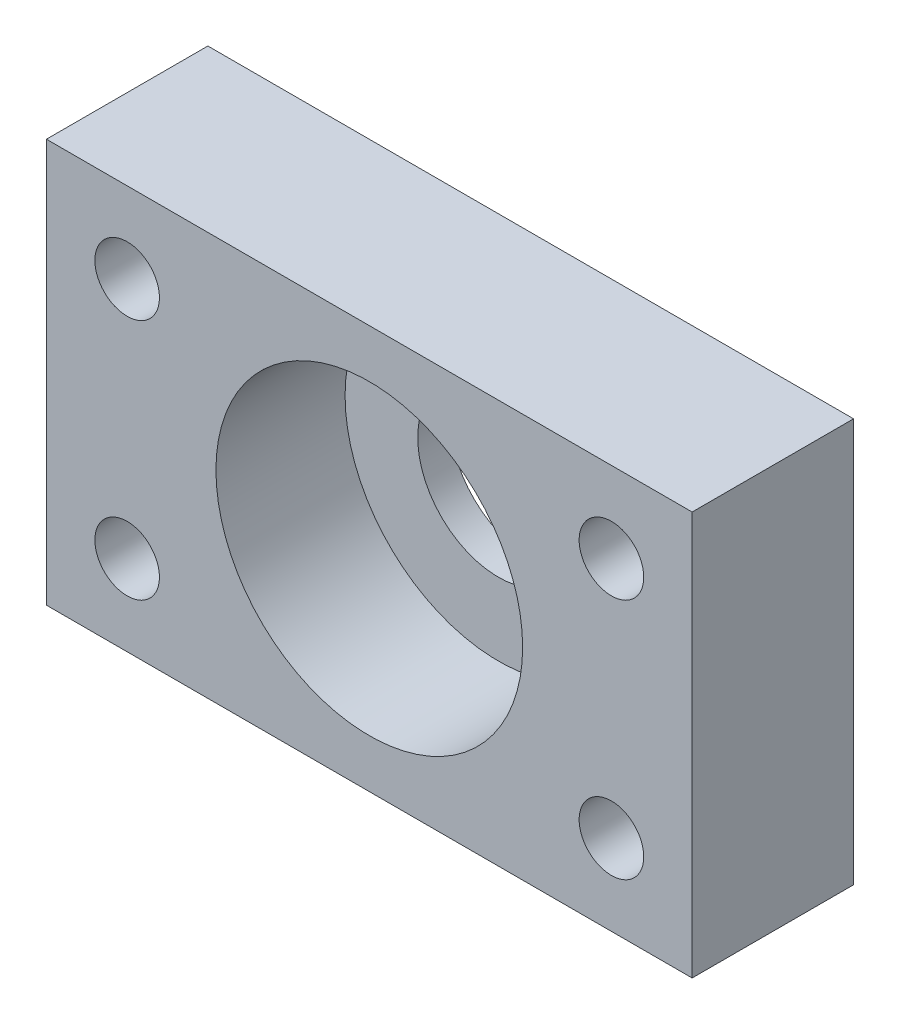
ISO-10303-21;
HEADER;
FILE_DESCRIPTION(('STEP AP214'),'2;1');
FILE_NAME('part.step','',(''),(''),'','','');
FILE_SCHEMA(('AUTOMOTIVE_DESIGN { 1 0 10303 214 1 1 1 1 }'));
ENDSEC;
DATA;
#1=APPLICATION_CONTEXT('core data for automotive mechanical design processes');
#2=APPLICATION_PROTOCOL_DEFINITION('international standard','automotive_design',2000,#1);
#3=PRODUCT_CONTEXT('',#1,'mechanical');
#4=PRODUCT('Part','Part','',(#3));
#5=PRODUCT_RELATED_PRODUCT_CATEGORY('part','',(#4));
#6=PRODUCT_DEFINITION_FORMATION('','',#4);
#7=PRODUCT_DEFINITION_CONTEXT('part definition',#1,'design');
#8=PRODUCT_DEFINITION('design','',#6,#7);
#9=PRODUCT_DEFINITION_SHAPE('','',#8);
#10=(LENGTH_UNIT() NAMED_UNIT(*) SI_UNIT(.MILLI.,.METRE.));
#11=(NAMED_UNIT(*) PLANE_ANGLE_UNIT() SI_UNIT($,.RADIAN.));
#12=(NAMED_UNIT(*) SI_UNIT($,.STERADIAN.) SOLID_ANGLE_UNIT());
#13=UNCERTAINTY_MEASURE_WITH_UNIT(LENGTH_MEASURE(1.E-05),#10,'distance_accuracy_value','');
#14=(GEOMETRIC_REPRESENTATION_CONTEXT(3) GLOBAL_UNCERTAINTY_ASSIGNED_CONTEXT((#13)) GLOBAL_UNIT_ASSIGNED_CONTEXT((#10,
#11,#12)) REPRESENTATION_CONTEXT('',''));
#15=CARTESIAN_POINT('',(0.,0.,0.));
#16=DIRECTION('',(0.,0.,1.));
#17=DIRECTION('',(1.,0.,0.));
#18=AXIS2_PLACEMENT_3D('',#15,#16,#17);
#19=CARTESIAN_POINT('',(5.17640495270519,0.,10.));
#20=DIRECTION('',(1.,0.,0.));
#21=DIRECTION('',(0.,1.,0.));
#22=AXIS2_PLACEMENT_3D('',#19,#20,#21);
#23=PLANE('',#22);
#24=DIRECTION('',(0.,-1.,0.));
#25=VECTOR('',#24,1.);
#26=CARTESIAN_POINT('',(5.17640495270519,0.,0.));
#27=LINE('',#26,#25);
#28=CARTESIAN_POINT('',(5.17640495270519,-9.74981387207115,0.));
#29=VERTEX_POINT('',#28);
#30=CARTESIAN_POINT('',(5.17640495270519,-34.7498138720712,0.));
#31=VERTEX_POINT('',#30);
#32=EDGE_CURVE('E119',#29,#31,#27,.T.);
#33=ORIENTED_EDGE('',*,*,#32,.F.);
#34=DIRECTION('',(0.,0.,-1.));
#35=VECTOR('',#34,1.);
#36=CARTESIAN_POINT('',(5.17640495270519,-9.74981387207115,10.));
#37=LINE('',#36,#35);
#38=CARTESIAN_POINT('',(5.17640495270519,-9.74981387207115,10.));
#39=VERTEX_POINT('',#38);
#40=EDGE_CURVE('E44',#39,#29,#37,.T.);
#41=ORIENTED_EDGE('',*,*,#40,.F.);
#42=DIRECTION('',(0.,-1.,0.));
#43=VECTOR('',#42,1.);
#44=CARTESIAN_POINT('',(5.17640495270519,0.,10.));
#45=LINE('',#44,#43);
#46=CARTESIAN_POINT('',(5.17640495270519,-34.7498138720712,10.));
#47=VERTEX_POINT('',#46);
#48=EDGE_CURVE('E99',#39,#47,#45,.T.);
#49=ORIENTED_EDGE('',*,*,#48,.T.);
#50=DIRECTION('',(0.,0.,-1.));
#51=VECTOR('',#50,1.);
#52=CARTESIAN_POINT('',(5.17640495270519,-34.7498138720712,10.));
#53=LINE('',#52,#51);
#54=EDGE_CURVE('E76',#47,#31,#53,.T.);
#55=ORIENTED_EDGE('',*,*,#54,.T.);
#56=EDGE_LOOP('',(#33,#41,#49,#55));
#57=FACE_BOUND('',#56,.T.);
#58=ADVANCED_FACE('F35',(#57),#23,.T.);
#59=CARTESIAN_POINT('',(0.,-9.74981387207115,10.));
#60=DIRECTION('',(0.,1.,0.));
#61=DIRECTION('',(0.,0.,1.));
#62=AXIS2_PLACEMENT_3D('',#59,#60,#61);
#63=PLANE('',#62);
#64=DIRECTION('',(1.,0.,0.));
#65=VECTOR('',#64,1.);
#66=CARTESIAN_POINT('',(0.,-9.74981387207115,0.));
#67=LINE('',#66,#65);
#68=CARTESIAN_POINT('',(-34.8235950472948,-9.74981387207115,0.));
#69=VERTEX_POINT('',#68);
#70=EDGE_CURVE('E89',#69,#29,#67,.T.);
#71=ORIENTED_EDGE('',*,*,#70,.F.);
#72=DIRECTION('',(0.,0.,-1.));
#73=VECTOR('',#72,1.);
#74=CARTESIAN_POINT('',(-34.8235950472948,-9.74981387207115,10.));
#75=LINE('',#74,#73);
#76=CARTESIAN_POINT('',(-34.8235950472948,-9.74981387207115,10.));
#77=VERTEX_POINT('',#76);
#78=EDGE_CURVE('E83',#77,#69,#75,.T.);
#79=ORIENTED_EDGE('',*,*,#78,.F.);
#80=DIRECTION('',(1.,0.,0.));
#81=VECTOR('',#80,1.);
#82=CARTESIAN_POINT('',(0.,-9.74981387207115,10.));
#83=LINE('',#82,#81);
#84=EDGE_CURVE('E87',#77,#39,#83,.T.);
#85=ORIENTED_EDGE('',*,*,#84,.T.);
#86=ORIENTED_EDGE('',*,*,#40,.T.);
#87=EDGE_LOOP('',(#71,#79,#85,#86));
#88=FACE_BOUND('',#87,.T.);
#89=ADVANCED_FACE('F85',(#88),#63,.T.);
#90=CARTESIAN_POINT('',(-34.8235950472948,0.,10.));
#91=DIRECTION('',(1.,0.,0.));
#92=DIRECTION('',(0.,1.,0.));
#93=AXIS2_PLACEMENT_3D('',#90,#91,#92);
#94=PLANE('',#93);
#95=DIRECTION('',(0.,-1.,0.));
#96=VECTOR('',#95,1.);
#97=CARTESIAN_POINT('',(-34.8235950472948,0.,0.));
#98=LINE('',#97,#96);
#99=CARTESIAN_POINT('',(-34.8235950472948,-34.7498138720712,0.));
#100=VERTEX_POINT('',#99);
#101=EDGE_CURVE('E122',#69,#100,#98,.T.);
#102=ORIENTED_EDGE('',*,*,#101,.T.);
#103=DIRECTION('',(0.,0.,-1.));
#104=VECTOR('',#103,1.);
#105=CARTESIAN_POINT('',(-34.8235950472948,-34.7498138720712,10.));
#106=LINE('',#105,#104);
#107=CARTESIAN_POINT('',(-34.8235950472948,-34.7498138720712,10.));
#108=VERTEX_POINT('',#107);
#109=EDGE_CURVE('E92',#108,#100,#106,.T.);
#110=ORIENTED_EDGE('',*,*,#109,.F.);
#111=DIRECTION('',(0.,-1.,0.));
#112=VECTOR('',#111,1.);
#113=CARTESIAN_POINT('',(-34.8235950472948,0.,10.));
#114=LINE('',#113,#112);
#115=EDGE_CURVE('E95',#77,#108,#114,.T.);
#116=ORIENTED_EDGE('',*,*,#115,.F.);
#117=ORIENTED_EDGE('',*,*,#78,.T.);
#118=EDGE_LOOP('',(#102,#110,#116,#117));
#119=FACE_BOUND('',#118,.T.);
#120=ADVANCED_FACE('F96',(#119),#94,.F.);
#121=CARTESIAN_POINT('',(-29.8235950472948,-14.7498138720712,10.));
#122=DIRECTION('',(0.,0.,-1.));
#123=DIRECTION('',(-1.,0.,0.));
#124=AXIS2_PLACEMENT_3D('',#121,#122,#123);
#125=CYLINDRICAL_SURFACE('',#124,2.);
#126=CARTESIAN_POINT('',(-29.8235950472948,-14.7498138720712,10.));
#127=DIRECTION('',(0.,0.,1.));
#128=DIRECTION('',(1.,0.,0.));
#129=AXIS2_PLACEMENT_3D('',#126,#127,#128);
#130=CIRCLE('',#129,2.);
#131=CARTESIAN_POINT('',(-27.8235950472948,-14.7498138720712,10.));
#132=VERTEX_POINT('',#131);
#133=EDGE_CURVE('E101',#132,#132,#130,.T.);
#134=ORIENTED_EDGE('',*,*,#133,.T.);
#135=EDGE_LOOP('',(#134));
#136=FACE_BOUND('',#135,.T.);
#137=CARTESIAN_POINT('',(-29.8235950472948,-14.7498138720712,0.));
#138=DIRECTION('',(0.,0.,1.));
#139=DIRECTION('',(1.,0.,0.));
#140=AXIS2_PLACEMENT_3D('',#137,#138,#139);
#141=CIRCLE('',#140,2.);
#142=CARTESIAN_POINT('',(-27.8235950472948,-14.7498138720712,0.));
#143=VERTEX_POINT('',#142);
#144=EDGE_CURVE('E116',#143,#143,#141,.T.);
#145=ORIENTED_EDGE('',*,*,#144,.F.);
#146=EDGE_LOOP('',(#145));
#147=FACE_BOUND('',#146,.T.);
#148=ADVANCED_FACE('F154',(#136,#147),#125,.F.);
#149=CARTESIAN_POINT('',(-29.8235950472948,-29.7498138720712,10.));
#150=DIRECTION('',(0.,0.,-1.));
#151=DIRECTION('',(-1.,0.,0.));
#152=AXIS2_PLACEMENT_3D('',#149,#150,#151);
#153=CYLINDRICAL_SURFACE('',#152,2.00000000000001);
#154=CARTESIAN_POINT('',(-29.8235950472948,-29.7498138720712,10.));
#155=DIRECTION('',(0.,0.,1.));
#156=DIRECTION('',(1.,0.,0.));
#157=AXIS2_PLACEMENT_3D('',#154,#155,#156);
#158=CIRCLE('',#157,2.00000000000001);
#159=CARTESIAN_POINT('',(-27.8235950472948,-29.7498138720712,10.));
#160=VERTEX_POINT('',#159);
#161=EDGE_CURVE('E149',#160,#160,#158,.T.);
#162=ORIENTED_EDGE('',*,*,#161,.T.);
#163=EDGE_LOOP('',(#162));
#164=FACE_BOUND('',#163,.T.);
#165=CARTESIAN_POINT('',(-29.8235950472948,-29.7498138720712,0.));
#166=DIRECTION('',(0.,0.,1.));
#167=DIRECTION('',(1.,0.,0.));
#168=AXIS2_PLACEMENT_3D('',#165,#166,#167);
#169=CIRCLE('',#168,2.00000000000001);
#170=CARTESIAN_POINT('',(-27.8235950472948,-29.7498138720712,0.));
#171=VERTEX_POINT('',#170);
#172=EDGE_CURVE('E113',#171,#171,#169,.T.);
#173=ORIENTED_EDGE('',*,*,#172,.F.);
#174=EDGE_LOOP('',(#173));
#175=FACE_BOUND('',#174,.T.);
#176=ADVANCED_FACE('F179',(#164,#175),#153,.F.);
#177=CARTESIAN_POINT('',(0.176404952705187,-14.7498138720711,10.));
#178=DIRECTION('',(0.,0.,-1.));
#179=DIRECTION('',(-1.,0.,0.));
#180=AXIS2_PLACEMENT_3D('',#177,#178,#179);
#181=CYLINDRICAL_SURFACE('',#180,2.);
#182=CARTESIAN_POINT('',(0.176404952705187,-14.7498138720711,10.));
#183=DIRECTION('',(0.,0.,1.));
#184=DIRECTION('',(1.,0.,0.));
#185=AXIS2_PLACEMENT_3D('',#182,#183,#184);
#186=CIRCLE('',#185,2.);
#187=CARTESIAN_POINT('',(2.17640495270519,-14.7498138720711,10.));
#188=VERTEX_POINT('',#187);
#189=EDGE_CURVE('E146',#188,#188,#186,.T.);
#190=ORIENTED_EDGE('',*,*,#189,.T.);
#191=EDGE_LOOP('',(#190));
#192=FACE_BOUND('',#191,.T.);
#193=CARTESIAN_POINT('',(0.176404952705187,-14.7498138720711,0.));
#194=DIRECTION('',(0.,0.,1.));
#195=DIRECTION('',(1.,0.,0.));
#196=AXIS2_PLACEMENT_3D('',#193,#194,#195);
#197=CIRCLE('',#196,2.);
#198=CARTESIAN_POINT('',(2.17640495270519,-14.7498138720711,0.));
#199=VERTEX_POINT('',#198);
#200=EDGE_CURVE('E109',#199,#199,#197,.T.);
#201=ORIENTED_EDGE('',*,*,#200,.F.);
#202=EDGE_LOOP('',(#201));
#203=FACE_BOUND('',#202,.T.);
#204=ADVANCED_FACE('F182',(#192,#203),#181,.F.);
#205=CARTESIAN_POINT('',(0.176404952705191,-29.7498138720711,10.));
#206=DIRECTION('',(0.,0.,-1.));
#207=DIRECTION('',(-1.,0.,0.));
#208=AXIS2_PLACEMENT_3D('',#205,#206,#207);
#209=CYLINDRICAL_SURFACE('',#208,2.);
#210=CARTESIAN_POINT('',(0.176404952705191,-29.7498138720711,10.));
#211=DIRECTION('',(0.,0.,1.));
#212=DIRECTION('',(1.,0.,0.));
#213=AXIS2_PLACEMENT_3D('',#210,#211,#212);
#214=CIRCLE('',#213,2.);
#215=CARTESIAN_POINT('',(2.17640495270519,-29.7498138720711,10.));
#216=VERTEX_POINT('',#215);
#217=EDGE_CURVE('E143',#216,#216,#214,.T.);
#218=ORIENTED_EDGE('',*,*,#217,.T.);
#219=EDGE_LOOP('',(#218));
#220=FACE_BOUND('',#219,.T.);
#221=CARTESIAN_POINT('',(0.176404952705191,-29.7498138720711,0.));
#222=DIRECTION('',(0.,0.,1.));
#223=DIRECTION('',(1.,0.,0.));
#224=AXIS2_PLACEMENT_3D('',#221,#222,#223);
#225=CIRCLE('',#224,2.);
#226=CARTESIAN_POINT('',(2.17640495270519,-29.7498138720711,0.));
#227=VERTEX_POINT('',#226);
#228=EDGE_CURVE('E106',#227,#227,#225,.T.);
#229=ORIENTED_EDGE('',*,*,#228,.F.);
#230=EDGE_LOOP('',(#229));
#231=FACE_BOUND('',#230,.T.);
#232=ADVANCED_FACE('F185',(#220,#231),#209,.F.);
#233=CARTESIAN_POINT('',(-14.8235950472948,-22.2498138720712,10.));
#234=DIRECTION('',(0.,0.,-1.));
#235=DIRECTION('',(-1.,0.,0.));
#236=AXIS2_PLACEMENT_3D('',#233,#234,#235);
#237=CYLINDRICAL_SURFACE('',#236,9.5);
#238=CARTESIAN_POINT('',(-14.8235950472948,-22.2498138720712,2.));
#239=DIRECTION('',(0.,0.,1.));
#240=DIRECTION('',(1.,0.,0.));
#241=AXIS2_PLACEMENT_3D('',#238,#239,#240);
#242=CIRCLE('',#241,9.5);
#243=CARTESIAN_POINT('',(-5.32359504729481,-22.2498138720712,2.));
#244=VERTEX_POINT('',#243);
#245=EDGE_CURVE('E11',#244,#244,#242,.T.);
#246=ORIENTED_EDGE('',*,*,#245,.F.);
#247=EDGE_LOOP('',(#246));
#248=FACE_BOUND('',#247,.T.);
#249=CARTESIAN_POINT('',(-14.8235950472948,-22.2498138720712,10.));
#250=DIRECTION('',(0.,0.,1.));
#251=DIRECTION('',(1.,0.,0.));
#252=AXIS2_PLACEMENT_3D('',#249,#250,#251);
#253=CIRCLE('',#252,9.5);
#254=CARTESIAN_POINT('',(-5.32359504729481,-22.2498138720712,10.));
#255=VERTEX_POINT('',#254);
#256=EDGE_CURVE('E125',#255,#255,#253,.T.);
#257=ORIENTED_EDGE('',*,*,#256,.T.);
#258=EDGE_LOOP('',(#257));
#259=FACE_BOUND('',#258,.T.);
#260=ADVANCED_FACE('F37',(#248,#259),#237,.F.);
#261=CARTESIAN_POINT('',(0.,-34.7498138720712,10.));
#262=DIRECTION('',(0.,1.,0.));
#263=DIRECTION('',(-1.,0.,0.));
#264=AXIS2_PLACEMENT_3D('',#261,#262,#263);
#265=PLANE('',#264);
#266=DIRECTION('',(1.,0.,0.));
#267=VECTOR('',#266,1.);
#268=CARTESIAN_POINT('',(0.,-34.7498138720712,0.));
#269=LINE('',#268,#267);
#270=EDGE_CURVE('E69',#100,#31,#269,.T.);
#271=ORIENTED_EDGE('',*,*,#270,.T.);
#272=ORIENTED_EDGE('',*,*,#54,.F.);
#273=DIRECTION('',(1.,0.,0.));
#274=VECTOR('',#273,1.);
#275=CARTESIAN_POINT('',(0.,-34.7498138720712,10.));
#276=LINE('',#275,#274);
#277=EDGE_CURVE('E52',#108,#47,#276,.T.);
#278=ORIENTED_EDGE('',*,*,#277,.F.);
#279=ORIENTED_EDGE('',*,*,#109,.T.);
#280=EDGE_LOOP('',(#271,#272,#278,#279));
#281=FACE_BOUND('',#280,.T.);
#282=ADVANCED_FACE('F158',(#281),#265,.F.);
#283=CARTESIAN_POINT('',(0.,0.,10.));
#284=DIRECTION('',(0.,0.,1.));
#285=DIRECTION('',(1.,0.,0.));
#286=AXIS2_PLACEMENT_3D('',#283,#284,#285);
#287=PLANE('',#286);
#288=ORIENTED_EDGE('',*,*,#256,.F.);
#289=EDGE_LOOP('',(#288));
#290=FACE_BOUND('',#289,.T.);
#291=ORIENTED_EDGE('',*,*,#217,.F.);
#292=EDGE_LOOP('',(#291));
#293=FACE_BOUND('',#292,.T.);
#294=ORIENTED_EDGE('',*,*,#189,.F.);
#295=EDGE_LOOP('',(#294));
#296=FACE_BOUND('',#295,.T.);
#297=ORIENTED_EDGE('',*,*,#161,.F.);
#298=EDGE_LOOP('',(#297));
#299=FACE_BOUND('',#298,.T.);
#300=ORIENTED_EDGE('',*,*,#133,.F.);
#301=EDGE_LOOP('',(#300));
#302=FACE_BOUND('',#301,.T.);
#303=ORIENTED_EDGE('',*,*,#48,.F.);
#304=ORIENTED_EDGE('',*,*,#84,.F.);
#305=ORIENTED_EDGE('',*,*,#115,.T.);
#306=ORIENTED_EDGE('',*,*,#277,.T.);
#307=EDGE_LOOP('',(#303,#304,#305,#306));
#308=FACE_BOUND('',#307,.T.);
#309=ADVANCED_FACE('F98',(#290,#293,#296,#299,#302,#308),#287,.T.);
#310=CARTESIAN_POINT('',(0.,0.,0.));
#311=DIRECTION('',(0.,0.,1.));
#312=DIRECTION('',(1.,0.,0.));
#313=AXIS2_PLACEMENT_3D('',#310,#311,#312);
#314=PLANE('',#313);
#315=ORIENTED_EDGE('',*,*,#228,.T.);
#316=EDGE_LOOP('',(#315));
#317=FACE_BOUND('',#316,.T.);
#318=ORIENTED_EDGE('',*,*,#200,.T.);
#319=EDGE_LOOP('',(#318));
#320=FACE_BOUND('',#319,.T.);
#321=ORIENTED_EDGE('',*,*,#172,.T.);
#322=EDGE_LOOP('',(#321));
#323=FACE_BOUND('',#322,.T.);
#324=ORIENTED_EDGE('',*,*,#144,.T.);
#325=EDGE_LOOP('',(#324));
#326=FACE_BOUND('',#325,.T.);
#327=ORIENTED_EDGE('',*,*,#32,.T.);
#328=ORIENTED_EDGE('',*,*,#270,.F.);
#329=ORIENTED_EDGE('',*,*,#101,.F.);
#330=ORIENTED_EDGE('',*,*,#70,.T.);
#331=EDGE_LOOP('',(#327,#328,#329,#330));
#332=FACE_BOUND('',#331,.T.);
#333=CARTESIAN_POINT('',(-14.8235950472948,-22.2498138720712,0.));
#334=DIRECTION('',(0.,0.,1.));
#335=DIRECTION('',(1.,0.,0.));
#336=AXIS2_PLACEMENT_3D('',#333,#334,#335);
#337=CIRCLE('',#336,5.);
#338=CARTESIAN_POINT('',(-9.82359504729481,-22.2498138720712,0.));
#339=VERTEX_POINT('',#338);
#340=EDGE_CURVE('E135',#339,#339,#337,.T.);
#341=ORIENTED_EDGE('',*,*,#340,.T.);
#342=EDGE_LOOP('',(#341));
#343=FACE_BOUND('',#342,.T.);
#344=ADVANCED_FACE('F127',(#317,#320,#323,#326,#332,#343),#314,.F.);
#345=CARTESIAN_POINT('',(-14.8235950472948,-22.2498138720712,2.));
#346=DIRECTION('',(0.,0.,-1.));
#347=DIRECTION('',(-1.,0.,0.));
#348=AXIS2_PLACEMENT_3D('',#345,#346,#347);
#349=CYLINDRICAL_SURFACE('',#348,5.);
#350=CARTESIAN_POINT('',(-14.8235950472948,-22.2498138720712,2.));
#351=DIRECTION('',(0.,0.,1.));
#352=DIRECTION('',(1.,0.,0.));
#353=AXIS2_PLACEMENT_3D('',#350,#351,#352);
#354=CIRCLE('',#353,5.);
#355=CARTESIAN_POINT('',(-9.82359504729481,-22.2498138720712,2.));
#356=VERTEX_POINT('',#355);
#357=EDGE_CURVE('E110',#356,#356,#354,.T.);
#358=ORIENTED_EDGE('',*,*,#357,.T.);
#359=EDGE_LOOP('',(#358));
#360=FACE_BOUND('',#359,.T.);
#361=ORIENTED_EDGE('',*,*,#340,.F.);
#362=EDGE_LOOP('',(#361));
#363=FACE_BOUND('',#362,.T.);
#364=ADVANCED_FACE('F130',(#360,#363),#349,.F.);
#365=CARTESIAN_POINT('',(0.,0.,2.));
#366=DIRECTION('',(0.,0.,1.));
#367=DIRECTION('',(1.,0.,0.));
#368=AXIS2_PLACEMENT_3D('',#365,#366,#367);
#369=PLANE('',#368);
#370=ORIENTED_EDGE('',*,*,#357,.F.);
#371=EDGE_LOOP('',(#370));
#372=FACE_BOUND('',#371,.T.);
#373=ORIENTED_EDGE('',*,*,#245,.T.);
#374=EDGE_LOOP('',(#373));
#375=FACE_BOUND('',#374,.T.);
#376=ADVANCED_FACE('F213',(#372,#375),#369,.T.);
#377=CLOSED_SHELL('',(#58,#89,#120,#148,#176,#204,#232,#260,#282,#309,#344,#364,#376));
#378=MANIFOLD_SOLID_BREP('B2',#377);
#379=ADVANCED_BREP_SHAPE_REPRESENTATION('',(#18,#378),#14);
#380=SHAPE_DEFINITION_REPRESENTATION(#9,#379);
ENDSEC;
END-ISO-10303-21;
